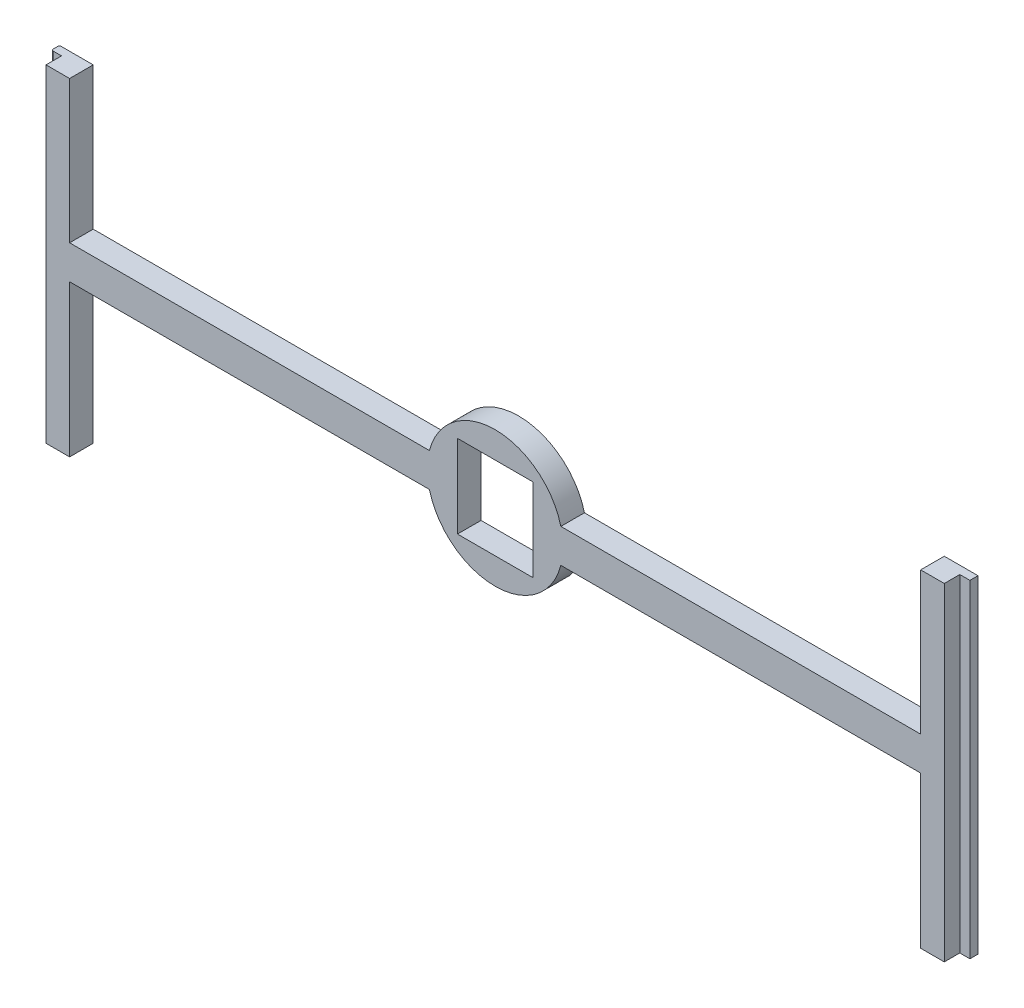
ISO-10303-21;
HEADER;
FILE_DESCRIPTION(('STEP AP214'),'2;1');
FILE_NAME('part.step','',(''),(''),'','','');
FILE_SCHEMA(('AUTOMOTIVE_DESIGN { 1 0 10303 214 1 1 1 1 }'));
ENDSEC;
DATA;
#1=APPLICATION_CONTEXT('core data for automotive mechanical design processes');
#2=APPLICATION_PROTOCOL_DEFINITION('international standard','automotive_design',2000,#1);
#3=PRODUCT_CONTEXT('',#1,'mechanical');
#4=PRODUCT('Part','Part','',(#3));
#5=PRODUCT_RELATED_PRODUCT_CATEGORY('part','',(#4));
#6=PRODUCT_DEFINITION_FORMATION('','',#4);
#7=PRODUCT_DEFINITION_CONTEXT('part definition',#1,'design');
#8=PRODUCT_DEFINITION('design','',#6,#7);
#9=PRODUCT_DEFINITION_SHAPE('','',#8);
#10=(LENGTH_UNIT() NAMED_UNIT(*) SI_UNIT(.MILLI.,.METRE.));
#11=(NAMED_UNIT(*) PLANE_ANGLE_UNIT() SI_UNIT($,.RADIAN.));
#12=(NAMED_UNIT(*) SI_UNIT($,.STERADIAN.) SOLID_ANGLE_UNIT());
#13=UNCERTAINTY_MEASURE_WITH_UNIT(LENGTH_MEASURE(1.E-05),#10,'distance_accuracy_value','');
#14=(GEOMETRIC_REPRESENTATION_CONTEXT(3) GLOBAL_UNCERTAINTY_ASSIGNED_CONTEXT((#13)) GLOBAL_UNIT_ASSIGNED_CONTEXT((#10,
#11,#12)) REPRESENTATION_CONTEXT('',''));
#15=CARTESIAN_POINT('',(0.,0.,0.));
#16=DIRECTION('',(0.,0.,1.));
#17=DIRECTION('',(1.,0.,0.));
#18=AXIS2_PLACEMENT_3D('',#15,#16,#17);
#19=CARTESIAN_POINT('',(0.,0.,3.5));
#20=DIRECTION('',(0.,0.,1.));
#21=DIRECTION('',(1.,0.,0.));
#22=AXIS2_PLACEMENT_3D('',#19,#20,#21);
#23=PLANE('',#22);
#24=DIRECTION('',(1.,0.,0.));
#25=VECTOR('',#24,1.);
#26=CARTESIAN_POINT('',(68.1,23.6,3.5));
#27=LINE('',#26,#25);
#28=CARTESIAN_POINT('',(-66.6,23.6,3.5));
#29=VERTEX_POINT('',#28);
#30=CARTESIAN_POINT('',(-63.1,23.6,3.5));
#31=VERTEX_POINT('',#30);
#32=EDGE_CURVE('E230',#29,#31,#27,.T.);
#33=ORIENTED_EDGE('',*,*,#32,.F.);
#34=DIRECTION('',(0.,-1.,0.));
#35=VECTOR('',#34,1.);
#36=CARTESIAN_POINT('',(-66.6,25.,3.49999999999998));
#37=LINE('',#36,#35);
#38=CARTESIAN_POINT('',(-66.6,-25.,3.49999999999998));
#39=VERTEX_POINT('',#38);
#40=EDGE_CURVE('E391',#29,#39,#37,.T.);
#41=ORIENTED_EDGE('',*,*,#40,.T.);
#42=DIRECTION('',(1.,0.,0.));
#43=VECTOR('',#42,1.);
#44=CARTESIAN_POINT('',(-63.1,-25.,3.5));
#45=LINE('',#44,#43);
#46=CARTESIAN_POINT('',(-63.1,-25.,3.5));
#47=VERTEX_POINT('',#46);
#48=EDGE_CURVE('E386',#39,#47,#45,.T.);
#49=ORIENTED_EDGE('',*,*,#48,.T.);
#50=DIRECTION('',(0.,1.,0.));
#51=VECTOR('',#50,1.);
#52=CARTESIAN_POINT('',(-63.1,-2.50000000000002,3.5));
#53=LINE('',#52,#51);
#54=CARTESIAN_POINT('',(-63.1,-2.50000000000002,3.5));
#55=VERTEX_POINT('',#54);
#56=EDGE_CURVE('E388',#47,#55,#53,.T.);
#57=ORIENTED_EDGE('',*,*,#56,.T.);
#58=DIRECTION('',(1.,0.,0.));
#59=VECTOR('',#58,1.);
#60=CARTESIAN_POINT('',(-63.1,-2.50000000000002,3.5));
#61=LINE('',#60,#59);
#62=CARTESIAN_POINT('',(-9.74276195747386,-2.50000000000002,3.5));
#63=VERTEX_POINT('',#62);
#64=EDGE_CURVE('E395',#55,#63,#61,.T.);
#65=ORIENTED_EDGE('',*,*,#64,.T.);
#66=CARTESIAN_POINT('',(0.,0.,3.5));
#67=DIRECTION('',(0.,0.,1.));
#68=DIRECTION('',(1.,0.,0.));
#69=AXIS2_PLACEMENT_3D('',#66,#67,#68);
#70=CIRCLE('',#69,10.0584);
#71=CARTESIAN_POINT('',(9.74276195747386,-2.50000000000002,3.5));
#72=VERTEX_POINT('',#71);
#73=EDGE_CURVE('E397',#63,#72,#70,.T.);
#74=ORIENTED_EDGE('',*,*,#73,.T.);
#75=DIRECTION('',(1.,0.,0.));
#76=VECTOR('',#75,1.);
#77=CARTESIAN_POINT('',(9.74276195747386,-2.50000000000002,3.5));
#78=LINE('',#77,#76);
#79=CARTESIAN_POINT('',(63.1,-2.5,3.5));
#80=VERTEX_POINT('',#79);
#81=EDGE_CURVE('E364',#72,#80,#78,.T.);
#82=ORIENTED_EDGE('',*,*,#81,.T.);
#83=DIRECTION('',(0.,-1.,0.));
#84=VECTOR('',#83,1.);
#85=CARTESIAN_POINT('',(63.1,-2.5,3.5));
#86=LINE('',#85,#84);
#87=CARTESIAN_POINT('',(63.1,-25.,3.5));
#88=VERTEX_POINT('',#87);
#89=EDGE_CURVE('E360',#80,#88,#86,.T.);
#90=ORIENTED_EDGE('',*,*,#89,.T.);
#91=DIRECTION('',(1.,0.,0.));
#92=VECTOR('',#91,1.);
#93=CARTESIAN_POINT('',(63.1,-25.,3.5));
#94=LINE('',#93,#92);
#95=CARTESIAN_POINT('',(66.6,-25.,3.5));
#96=VERTEX_POINT('',#95);
#97=EDGE_CURVE('E354',#88,#96,#94,.T.);
#98=ORIENTED_EDGE('',*,*,#97,.T.);
#99=DIRECTION('',(0.,-1.,0.));
#100=VECTOR('',#99,1.);
#101=CARTESIAN_POINT('',(66.6,25.,3.5));
#102=LINE('',#101,#100);
#103=CARTESIAN_POINT('',(66.6,23.6,3.5));
#104=VERTEX_POINT('',#103);
#105=EDGE_CURVE('E333',#104,#96,#102,.T.);
#106=ORIENTED_EDGE('',*,*,#105,.F.);
#107=CARTESIAN_POINT('',(63.1,23.6,3.5));
#108=VERTEX_POINT('',#107);
#109=EDGE_CURVE('E454',#108,#104,#27,.T.);
#110=ORIENTED_EDGE('',*,*,#109,.F.);
#111=DIRECTION('',(0.,-1.,0.));
#112=VECTOR('',#111,1.);
#113=CARTESIAN_POINT('',(63.1,25.,3.5));
#114=LINE('',#113,#112);
#115=CARTESIAN_POINT('',(63.1,2.5,3.5));
#116=VERTEX_POINT('',#115);
#117=EDGE_CURVE('E359',#108,#116,#114,.T.);
#118=ORIENTED_EDGE('',*,*,#117,.T.);
#119=DIRECTION('',(-1.,0.,0.));
#120=VECTOR('',#119,1.);
#121=CARTESIAN_POINT('',(9.74276195747386,2.50000000000002,3.5));
#122=LINE('',#121,#120);
#123=CARTESIAN_POINT('',(9.74276195747386,2.50000000000002,3.5));
#124=VERTEX_POINT('',#123);
#125=EDGE_CURVE('E362',#116,#124,#122,.T.);
#126=ORIENTED_EDGE('',*,*,#125,.T.);
#127=CARTESIAN_POINT('',(0.,0.,3.5));
#128=DIRECTION('',(0.,0.,1.));
#129=DIRECTION('',(1.,0.,0.));
#130=AXIS2_PLACEMENT_3D('',#127,#128,#129);
#131=CIRCLE('',#130,10.0584);
#132=CARTESIAN_POINT('',(-9.74276195747386,2.50000000000002,3.5));
#133=VERTEX_POINT('',#132);
#134=EDGE_CURVE('E369',#124,#133,#131,.T.);
#135=ORIENTED_EDGE('',*,*,#134,.T.);
#136=DIRECTION('',(-1.,0.,0.));
#137=VECTOR('',#136,1.);
#138=CARTESIAN_POINT('',(-63.1,2.50000000000002,3.5));
#139=LINE('',#138,#137);
#140=CARTESIAN_POINT('',(-63.1,2.50000000000002,3.5));
#141=VERTEX_POINT('',#140);
#142=EDGE_CURVE('E254',#133,#141,#139,.T.);
#143=ORIENTED_EDGE('',*,*,#142,.T.);
#144=DIRECTION('',(0.,1.,0.));
#145=VECTOR('',#144,1.);
#146=CARTESIAN_POINT('',(-63.1,25.,3.5));
#147=LINE('',#146,#145);
#148=EDGE_CURVE('E249',#141,#31,#147,.T.);
#149=ORIENTED_EDGE('',*,*,#148,.T.);
#150=EDGE_LOOP('',(#33,#41,#49,#57,#65,#74,#82,#90,#98,#106,#110,#118,#126,#135,#143,#149));
#151=FACE_BOUND('',#150,.T.);
#152=DIRECTION('',(0.,1.,0.));
#153=VECTOR('',#152,1.);
#154=CARTESIAN_POINT('',(5.588,-6.1468,3.5));
#155=LINE('',#154,#153);
#156=CARTESIAN_POINT('',(5.588,-6.1468,3.5));
#157=VERTEX_POINT('',#156);
#158=CARTESIAN_POINT('',(5.588,6.1468,3.5));
#159=VERTEX_POINT('',#158);
#160=EDGE_CURVE('E467',#157,#159,#155,.T.);
#161=ORIENTED_EDGE('',*,*,#160,.F.);
#162=DIRECTION('',(1.,0.,0.));
#163=VECTOR('',#162,1.);
#164=CARTESIAN_POINT('',(-5.588,-6.1468,3.5));
#165=LINE('',#164,#163);
#166=CARTESIAN_POINT('',(-5.588,-6.1468,3.5));
#167=VERTEX_POINT('',#166);
#168=EDGE_CURVE('E478',#167,#157,#165,.T.);
#169=ORIENTED_EDGE('',*,*,#168,.F.);
#170=DIRECTION('',(0.,-1.,0.));
#171=VECTOR('',#170,1.);
#172=CARTESIAN_POINT('',(-5.588,-6.1468,3.5));
#173=LINE('',#172,#171);
#174=CARTESIAN_POINT('',(-5.588,6.1468,3.5));
#175=VERTEX_POINT('',#174);
#176=EDGE_CURVE('E475',#175,#167,#173,.T.);
#177=ORIENTED_EDGE('',*,*,#176,.F.);
#178=DIRECTION('',(-1.,0.,0.));
#179=VECTOR('',#178,1.);
#180=CARTESIAN_POINT('',(-5.588,6.1468,3.5));
#181=LINE('',#180,#179);
#182=EDGE_CURVE('E469',#159,#175,#181,.T.);
#183=ORIENTED_EDGE('',*,*,#182,.F.);
#184=EDGE_LOOP('',(#161,#169,#177,#183));
#185=FACE_BOUND('',#184,.T.);
#186=ADVANCED_FACE('F35',(#151,#185),#23,.T.);
#187=CARTESIAN_POINT('',(0.,0.,0.));
#188=DIRECTION('',(0.,0.,1.));
#189=DIRECTION('',(1.,0.,0.));
#190=AXIS2_PLACEMENT_3D('',#187,#188,#189);
#191=PLANE('',#190);
#192=DIRECTION('',(1.,0.,0.));
#193=VECTOR('',#192,1.);
#194=CARTESIAN_POINT('',(0.,-6.1468,0.));
#195=LINE('',#194,#193);
#196=CARTESIAN_POINT('',(-5.588,-6.1468,0.));
#197=VERTEX_POINT('',#196);
#198=CARTESIAN_POINT('',(5.588,-6.1468,0.));
#199=VERTEX_POINT('',#198);
#200=EDGE_CURVE('E291',#197,#199,#195,.T.);
#201=ORIENTED_EDGE('',*,*,#200,.T.);
#202=DIRECTION('',(0.,1.,0.));
#203=VECTOR('',#202,1.);
#204=CARTESIAN_POINT('',(5.588,0.,0.));
#205=LINE('',#204,#203);
#206=CARTESIAN_POINT('',(5.588,6.1468,0.));
#207=VERTEX_POINT('',#206);
#208=EDGE_CURVE('E294',#199,#207,#205,.T.);
#209=ORIENTED_EDGE('',*,*,#208,.T.);
#210=DIRECTION('',(-1.,0.,0.));
#211=VECTOR('',#210,1.);
#212=CARTESIAN_POINT('',(0.,6.1468,0.));
#213=LINE('',#212,#211);
#214=CARTESIAN_POINT('',(-5.588,6.1468,0.));
#215=VERTEX_POINT('',#214);
#216=EDGE_CURVE('E285',#207,#215,#213,.T.);
#217=ORIENTED_EDGE('',*,*,#216,.T.);
#218=DIRECTION('',(0.,-1.,0.));
#219=VECTOR('',#218,1.);
#220=CARTESIAN_POINT('',(-5.588,0.,0.));
#221=LINE('',#220,#219);
#222=EDGE_CURVE('E288',#215,#197,#221,.T.);
#223=ORIENTED_EDGE('',*,*,#222,.T.);
#224=EDGE_LOOP('',(#201,#209,#217,#223));
#225=FACE_BOUND('',#224,.T.);
#226=DIRECTION('',(1.,0.,0.));
#227=VECTOR('',#226,1.);
#228=CARTESIAN_POINT('',(-63.1,-25.,0.));
#229=LINE('',#228,#227);
#230=CARTESIAN_POINT('',(-67.8,-25.,0.));
#231=VERTEX_POINT('',#230);
#232=CARTESIAN_POINT('',(-63.1,-25.,0.));
#233=VERTEX_POINT('',#232);
#234=EDGE_CURVE('E324',#231,#233,#229,.T.);
#235=ORIENTED_EDGE('',*,*,#234,.F.);
#236=DIRECTION('',(0.,-1.,0.));
#237=VECTOR('',#236,1.);
#238=CARTESIAN_POINT('',(-67.8,0.,0.));
#239=LINE('',#238,#237);
#240=CARTESIAN_POINT('',(-67.8,23.6,0.));
#241=VERTEX_POINT('',#240);
#242=EDGE_CURVE('E58',#231,#241,#239,.F.);
#243=ORIENTED_EDGE('',*,*,#242,.T.);
#244=DIRECTION('',(1.,0.,0.));
#245=VECTOR('',#244,1.);
#246=CARTESIAN_POINT('',(68.1,23.6,0.));
#247=LINE('',#246,#245);
#248=CARTESIAN_POINT('',(-63.1,23.6,0.));
#249=VERTEX_POINT('',#248);
#250=EDGE_CURVE('E229',#241,#249,#247,.T.);
#251=ORIENTED_EDGE('',*,*,#250,.T.);
#252=DIRECTION('',(0.,1.,0.));
#253=VECTOR('',#252,1.);
#254=CARTESIAN_POINT('',(-63.1,25.,0.));
#255=LINE('',#254,#253);
#256=CARTESIAN_POINT('',(-63.1,2.50000000000002,0.));
#257=VERTEX_POINT('',#256);
#258=EDGE_CURVE('E328',#257,#249,#255,.T.);
#259=ORIENTED_EDGE('',*,*,#258,.F.);
#260=DIRECTION('',(-1.,0.,0.));
#261=VECTOR('',#260,1.);
#262=CARTESIAN_POINT('',(-63.1,2.50000000000002,0.));
#263=LINE('',#262,#261);
#264=CARTESIAN_POINT('',(-9.74276195747386,2.50000000000002,0.));
#265=VERTEX_POINT('',#264);
#266=EDGE_CURVE('E247',#265,#257,#263,.T.);
#267=ORIENTED_EDGE('',*,*,#266,.F.);
#268=CARTESIAN_POINT('',(0.,0.,0.));
#269=DIRECTION('',(0.,0.,1.));
#270=DIRECTION('',(1.,0.,0.));
#271=AXIS2_PLACEMENT_3D('',#268,#269,#270);
#272=CIRCLE('',#271,10.0584);
#273=CARTESIAN_POINT('',(9.74276195747386,2.50000000000002,0.));
#274=VERTEX_POINT('',#273);
#275=EDGE_CURVE('E245',#274,#265,#272,.T.);
#276=ORIENTED_EDGE('',*,*,#275,.F.);
#277=DIRECTION('',(-1.,0.,0.));
#278=VECTOR('',#277,1.);
#279=CARTESIAN_POINT('',(9.74276195747386,2.50000000000002,0.));
#280=LINE('',#279,#278);
#281=CARTESIAN_POINT('',(63.1,2.5,0.));
#282=VERTEX_POINT('',#281);
#283=EDGE_CURVE('E238',#282,#274,#280,.T.);
#284=ORIENTED_EDGE('',*,*,#283,.F.);
#285=DIRECTION('',(0.,-1.,0.));
#286=VECTOR('',#285,1.);
#287=CARTESIAN_POINT('',(63.1,25.,0.));
#288=LINE('',#287,#286);
#289=CARTESIAN_POINT('',(63.1,23.6,0.));
#290=VERTEX_POINT('',#289);
#291=EDGE_CURVE('E228',#290,#282,#288,.T.);
#292=ORIENTED_EDGE('',*,*,#291,.F.);
#293=CARTESIAN_POINT('',(68.1,23.6,0.));
#294=VERTEX_POINT('',#293);
#295=EDGE_CURVE('E212',#290,#294,#247,.T.);
#296=ORIENTED_EDGE('',*,*,#295,.T.);
#297=DIRECTION('',(0.,1.,0.));
#298=VECTOR('',#297,1.);
#299=CARTESIAN_POINT('',(68.1,25.,0.));
#300=LINE('',#299,#298);
#301=CARTESIAN_POINT('',(68.1,-25.,0.));
#302=VERTEX_POINT('',#301);
#303=EDGE_CURVE('E226',#302,#294,#300,.T.);
#304=ORIENTED_EDGE('',*,*,#303,.F.);
#305=DIRECTION('',(1.,0.,0.));
#306=VECTOR('',#305,1.);
#307=CARTESIAN_POINT('',(63.1,-25.,0.));
#308=LINE('',#307,#306);
#309=CARTESIAN_POINT('',(63.1,-25.,0.));
#310=VERTEX_POINT('',#309);
#311=EDGE_CURVE('E236',#310,#302,#308,.T.);
#312=ORIENTED_EDGE('',*,*,#311,.F.);
#313=DIRECTION('',(0.,-1.,0.));
#314=VECTOR('',#313,1.);
#315=CARTESIAN_POINT('',(63.1,-2.5,0.));
#316=LINE('',#315,#314);
#317=CARTESIAN_POINT('',(63.1,-2.5,0.));
#318=VERTEX_POINT('',#317);
#319=EDGE_CURVE('E240',#318,#310,#316,.T.);
#320=ORIENTED_EDGE('',*,*,#319,.F.);
#321=DIRECTION('',(1.,0.,0.));
#322=VECTOR('',#321,1.);
#323=CARTESIAN_POINT('',(9.74276195747386,-2.50000000000002,0.));
#324=LINE('',#323,#322);
#325=CARTESIAN_POINT('',(9.74276195747386,-2.50000000000002,0.));
#326=VERTEX_POINT('',#325);
#327=EDGE_CURVE('E340',#326,#318,#324,.T.);
#328=ORIENTED_EDGE('',*,*,#327,.F.);
#329=CARTESIAN_POINT('',(0.,0.,0.));
#330=DIRECTION('',(0.,0.,1.));
#331=DIRECTION('',(1.,0.,0.));
#332=AXIS2_PLACEMENT_3D('',#329,#330,#331);
#333=CIRCLE('',#332,10.0584);
#334=CARTESIAN_POINT('',(-9.74276195747386,-2.50000000000002,0.));
#335=VERTEX_POINT('',#334);
#336=EDGE_CURVE('E338',#335,#326,#333,.T.);
#337=ORIENTED_EDGE('',*,*,#336,.F.);
#338=DIRECTION('',(1.,0.,0.));
#339=VECTOR('',#338,1.);
#340=CARTESIAN_POINT('',(-63.1,-2.50000000000002,0.));
#341=LINE('',#340,#339);
#342=CARTESIAN_POINT('',(-63.1,-2.50000000000002,0.));
#343=VERTEX_POINT('',#342);
#344=EDGE_CURVE('E330',#343,#335,#341,.T.);
#345=ORIENTED_EDGE('',*,*,#344,.F.);
#346=DIRECTION('',(0.,1.,0.));
#347=VECTOR('',#346,1.);
#348=CARTESIAN_POINT('',(-63.1,-2.50000000000002,0.));
#349=LINE('',#348,#347);
#350=EDGE_CURVE('E327',#233,#343,#349,.T.);
#351=ORIENTED_EDGE('',*,*,#350,.F.);
#352=EDGE_LOOP('',(#235,#243,#251,#259,#267,#276,#284,#292,#296,#304,#312,#320,#328,#337,#345,#351));
#353=FACE_BOUND('',#352,.T.);
#354=ADVANCED_FACE('F224',(#225,#353),#191,.F.);
#355=CARTESIAN_POINT('',(-63.1,25.,3.5));
#356=DIRECTION('',(-1.,0.,0.));
#357=DIRECTION('',(0.,-1.,0.));
#358=AXIS2_PLACEMENT_3D('',#355,#356,#357);
#359=PLANE('',#358);
#360=ORIENTED_EDGE('',*,*,#258,.T.);
#361=DIRECTION('',(0.,0.,1.));
#362=VECTOR('',#361,1.);
#363=CARTESIAN_POINT('',(-63.1,23.6,3.5));
#364=LINE('',#363,#362);
#365=EDGE_CURVE('E385',#249,#31,#364,.T.);
#366=ORIENTED_EDGE('',*,*,#365,.T.);
#367=ORIENTED_EDGE('',*,*,#148,.F.);
#368=DIRECTION('',(0.,0.,-1.));
#369=VECTOR('',#368,1.);
#370=CARTESIAN_POINT('',(-63.1,2.50000000000002,3.5));
#371=LINE('',#370,#369);
#372=EDGE_CURVE('E250',#141,#257,#371,.T.);
#373=ORIENTED_EDGE('',*,*,#372,.T.);
#374=EDGE_LOOP('',(#360,#366,#367,#373));
#375=FACE_BOUND('',#374,.T.);
#376=ADVANCED_FACE('F384',(#375),#359,.F.);
#377=CARTESIAN_POINT('',(-68.1,25.,3.5));
#378=DIRECTION('',(1.,0.,0.));
#379=DIRECTION('',(0.,0.,-1.));
#380=AXIS2_PLACEMENT_3D('',#377,#378,#379);
#381=PLANE('',#380);
#382=DIRECTION('',(0.,0.,1.));
#383=VECTOR('',#382,1.);
#384=CARTESIAN_POINT('',(-68.1,23.6,0.));
#385=LINE('',#384,#383);
#386=CARTESIAN_POINT('',(-68.1,23.6,0.3));
#387=VERTEX_POINT('',#386);
#388=CARTESIAN_POINT('',(-68.1,23.6,0.899999999999984));
#389=VERTEX_POINT('',#388);
#390=EDGE_CURVE('E220',#387,#389,#385,.T.);
#391=ORIENTED_EDGE('',*,*,#390,.F.);
#392=DIRECTION('',(0.,-1.,0.));
#393=VECTOR('',#392,1.);
#394=CARTESIAN_POINT('',(-68.1,25.,0.3));
#395=LINE('',#394,#393);
#396=CARTESIAN_POINT('',(-68.1,-25.,0.3));
#397=VERTEX_POINT('',#396);
#398=EDGE_CURVE('E301',#387,#397,#395,.T.);
#399=ORIENTED_EDGE('',*,*,#398,.T.);
#400=DIRECTION('',(0.,0.,-1.));
#401=VECTOR('',#400,1.);
#402=CARTESIAN_POINT('',(-68.1,-25.,3.5));
#403=LINE('',#402,#401);
#404=CARTESIAN_POINT('',(-68.1,-25.,0.899999999999984));
#405=VERTEX_POINT('',#404);
#406=EDGE_CURVE('E282',#405,#397,#403,.T.);
#407=ORIENTED_EDGE('',*,*,#406,.F.);
#408=DIRECTION('',(0.,-1.,0.));
#409=VECTOR('',#408,1.);
#410=CARTESIAN_POINT('',(-68.1,25.,0.899999999999984));
#411=LINE('',#410,#409);
#412=EDGE_CURVE('E299',#405,#389,#411,.F.);
#413=ORIENTED_EDGE('',*,*,#412,.T.);
#414=EDGE_LOOP('',(#391,#399,#407,#413));
#415=FACE_BOUND('',#414,.T.);
#416=ADVANCED_FACE('F316',(#415),#381,.F.);
#417=CARTESIAN_POINT('',(-63.1,-25.,3.5));
#418=DIRECTION('',(0.,1.,0.));
#419=DIRECTION('',(-1.,0.,0.));
#420=AXIS2_PLACEMENT_3D('',#417,#418,#419);
#421=PLANE('',#420);
#422=ORIENTED_EDGE('',*,*,#406,.T.);
#423=CARTESIAN_POINT('',(-67.8,-25.,0.3));
#424=DIRECTION('',(0.,1.,0.));
#425=DIRECTION('',(-1.,0.,0.));
#426=AXIS2_PLACEMENT_3D('',#423,#424,#425);
#427=CIRCLE('',#426,0.3);
#428=EDGE_CURVE('E306',#397,#231,#427,.F.);
#429=ORIENTED_EDGE('',*,*,#428,.T.);
#430=ORIENTED_EDGE('',*,*,#234,.T.);
#431=DIRECTION('',(0.,0.,-1.));
#432=VECTOR('',#431,1.);
#433=CARTESIAN_POINT('',(-63.1,-25.,3.5));
#434=LINE('',#433,#432);
#435=EDGE_CURVE('E279',#47,#233,#434,.T.);
#436=ORIENTED_EDGE('',*,*,#435,.F.);
#437=ORIENTED_EDGE('',*,*,#48,.F.);
#438=DIRECTION('',(0.,0.,1.));
#439=VECTOR('',#438,1.);
#440=CARTESIAN_POINT('',(-66.6,-25.,3.49999999999998));
#441=LINE('',#440,#439);
#442=CARTESIAN_POINT('',(-66.6,-25.,1.19999999999998));
#443=VERTEX_POINT('',#442);
#444=EDGE_CURVE('E418',#443,#39,#441,.T.);
#445=ORIENTED_EDGE('',*,*,#444,.F.);
#446=DIRECTION('',(1.,0.,0.));
#447=VECTOR('',#446,1.);
#448=CARTESIAN_POINT('',(-66.6,-25.,1.19999999999998));
#449=LINE('',#448,#447);
#450=CARTESIAN_POINT('',(-67.8,-25.,1.19999999999998));
#451=VERTEX_POINT('',#450);
#452=EDGE_CURVE('E423',#451,#443,#449,.T.);
#453=ORIENTED_EDGE('',*,*,#452,.F.);
#454=CARTESIAN_POINT('',(-67.8,-25.,0.899999999999984));
#455=DIRECTION('',(0.,1.,0.));
#456=DIRECTION('',(-1.,0.,0.));
#457=AXIS2_PLACEMENT_3D('',#454,#455,#456);
#458=CIRCLE('',#457,0.3);
#459=EDGE_CURVE('E304',#451,#405,#458,.F.);
#460=ORIENTED_EDGE('',*,*,#459,.T.);
#461=EDGE_LOOP('',(#422,#429,#430,#436,#437,#445,#453,#460));
#462=FACE_BOUND('',#461,.T.);
#463=ADVANCED_FACE('F322',(#462),#421,.F.);
#464=CARTESIAN_POINT('',(-63.1,-2.50000000000002,3.5));
#465=DIRECTION('',(-1.,0.,0.));
#466=DIRECTION('',(0.,-1.,0.));
#467=AXIS2_PLACEMENT_3D('',#464,#465,#466);
#468=PLANE('',#467);
#469=ORIENTED_EDGE('',*,*,#350,.T.);
#470=DIRECTION('',(0.,0.,-1.));
#471=VECTOR('',#470,1.);
#472=CARTESIAN_POINT('',(-63.1,-2.50000000000002,3.5));
#473=LINE('',#472,#471);
#474=EDGE_CURVE('E276',#55,#343,#473,.T.);
#475=ORIENTED_EDGE('',*,*,#474,.F.);
#476=ORIENTED_EDGE('',*,*,#56,.F.);
#477=ORIENTED_EDGE('',*,*,#435,.T.);
#478=EDGE_LOOP('',(#469,#475,#476,#477));
#479=FACE_BOUND('',#478,.T.);
#480=ADVANCED_FACE('F413',(#479),#468,.F.);
#481=CARTESIAN_POINT('',(-63.1,-2.50000000000002,3.5));
#482=DIRECTION('',(0.,1.,0.));
#483=DIRECTION('',(-1.,0.,0.));
#484=AXIS2_PLACEMENT_3D('',#481,#482,#483);
#485=PLANE('',#484);
#486=ORIENTED_EDGE('',*,*,#344,.T.);
#487=DIRECTION('',(0.,0.,-1.));
#488=VECTOR('',#487,1.);
#489=CARTESIAN_POINT('',(-9.74276195747386,-2.50000000000002,3.5));
#490=LINE('',#489,#488);
#491=EDGE_CURVE('E273',#63,#335,#490,.T.);
#492=ORIENTED_EDGE('',*,*,#491,.F.);
#493=ORIENTED_EDGE('',*,*,#64,.F.);
#494=ORIENTED_EDGE('',*,*,#474,.T.);
#495=EDGE_LOOP('',(#486,#492,#493,#494));
#496=FACE_BOUND('',#495,.T.);
#497=ADVANCED_FACE('F409',(#496),#485,.F.);
#498=CARTESIAN_POINT('',(0.,0.,3.5));
#499=DIRECTION('',(0.,0.,-1.));
#500=DIRECTION('',(-1.,0.,0.));
#501=AXIS2_PLACEMENT_3D('',#498,#499,#500);
#502=CYLINDRICAL_SURFACE('',#501,10.0584);
#503=ORIENTED_EDGE('',*,*,#336,.T.);
#504=DIRECTION('',(0.,0.,-1.));
#505=VECTOR('',#504,1.);
#506=CARTESIAN_POINT('',(9.74276195747386,-2.50000000000002,3.5));
#507=LINE('',#506,#505);
#508=EDGE_CURVE('E270',#72,#326,#507,.T.);
#509=ORIENTED_EDGE('',*,*,#508,.F.);
#510=ORIENTED_EDGE('',*,*,#73,.F.);
#511=ORIENTED_EDGE('',*,*,#491,.T.);
#512=EDGE_LOOP('',(#503,#509,#510,#511));
#513=FACE_BOUND('',#512,.T.);
#514=ADVANCED_FACE('F405',(#513),#502,.T.);
#515=CARTESIAN_POINT('',(9.74276195747386,-2.50000000000002,3.5));
#516=DIRECTION('',(0.,1.,0.));
#517=DIRECTION('',(-1.,0.,0.));
#518=AXIS2_PLACEMENT_3D('',#515,#516,#517);
#519=PLANE('',#518);
#520=ORIENTED_EDGE('',*,*,#327,.T.);
#521=DIRECTION('',(0.,0.,-1.));
#522=VECTOR('',#521,1.);
#523=CARTESIAN_POINT('',(63.1,-2.5,3.5));
#524=LINE('',#523,#522);
#525=EDGE_CURVE('E267',#80,#318,#524,.T.);
#526=ORIENTED_EDGE('',*,*,#525,.F.);
#527=ORIENTED_EDGE('',*,*,#81,.F.);
#528=ORIENTED_EDGE('',*,*,#508,.T.);
#529=EDGE_LOOP('',(#520,#526,#527,#528));
#530=FACE_BOUND('',#529,.T.);
#531=ADVANCED_FACE('F402',(#530),#519,.F.);
#532=CARTESIAN_POINT('',(63.1,-2.5,3.5));
#533=DIRECTION('',(1.,0.,0.));
#534=DIRECTION('',(0.,1.,0.));
#535=AXIS2_PLACEMENT_3D('',#532,#533,#534);
#536=PLANE('',#535);
#537=ORIENTED_EDGE('',*,*,#319,.T.);
#538=DIRECTION('',(0.,0.,-1.));
#539=VECTOR('',#538,1.);
#540=CARTESIAN_POINT('',(63.1,-25.,3.5));
#541=LINE('',#540,#539);
#542=EDGE_CURVE('E264',#88,#310,#541,.T.);
#543=ORIENTED_EDGE('',*,*,#542,.F.);
#544=ORIENTED_EDGE('',*,*,#89,.F.);
#545=ORIENTED_EDGE('',*,*,#525,.T.);
#546=EDGE_LOOP('',(#537,#543,#544,#545));
#547=FACE_BOUND('',#546,.T.);
#548=ADVANCED_FACE('F344',(#547),#536,.F.);
#549=CARTESIAN_POINT('',(63.1,-25.,3.5));
#550=DIRECTION('',(0.,1.,0.));
#551=DIRECTION('',(0.,0.,1.));
#552=AXIS2_PLACEMENT_3D('',#549,#550,#551);
#553=PLANE('',#552);
#554=DIRECTION('',(1.,0.,0.));
#555=VECTOR('',#554,1.);
#556=CARTESIAN_POINT('',(66.6,-25.,1.2));
#557=LINE('',#556,#555);
#558=CARTESIAN_POINT('',(66.6,-25.,1.2));
#559=VERTEX_POINT('',#558);
#560=CARTESIAN_POINT('',(68.1,-25.,1.2));
#561=VERTEX_POINT('',#560);
#562=EDGE_CURVE('E435',#559,#561,#557,.T.);
#563=ORIENTED_EDGE('',*,*,#562,.F.);
#564=DIRECTION('',(0.,0.,-1.));
#565=VECTOR('',#564,1.);
#566=CARTESIAN_POINT('',(66.6,-25.,3.5));
#567=LINE('',#566,#565);
#568=EDGE_CURVE('E356',#96,#559,#567,.T.);
#569=ORIENTED_EDGE('',*,*,#568,.F.);
#570=ORIENTED_EDGE('',*,*,#97,.F.);
#571=ORIENTED_EDGE('',*,*,#542,.T.);
#572=ORIENTED_EDGE('',*,*,#311,.T.);
#573=DIRECTION('',(0.,0.,-1.));
#574=VECTOR('',#573,1.);
#575=CARTESIAN_POINT('',(68.1,-25.,3.5));
#576=LINE('',#575,#574);
#577=EDGE_CURVE('E234',#561,#302,#576,.T.);
#578=ORIENTED_EDGE('',*,*,#577,.F.);
#579=EDGE_LOOP('',(#563,#569,#570,#571,#572,#578));
#580=FACE_BOUND('',#579,.T.);
#581=ADVANCED_FACE('F351',(#580),#553,.F.);
#582=CARTESIAN_POINT('',(68.1,25.,3.5));
#583=DIRECTION('',(-1.,0.,0.));
#584=DIRECTION('',(0.,0.,1.));
#585=AXIS2_PLACEMENT_3D('',#582,#583,#584);
#586=PLANE('',#585);
#587=ORIENTED_EDGE('',*,*,#303,.T.);
#588=DIRECTION('',(0.,0.,1.));
#589=VECTOR('',#588,1.);
#590=CARTESIAN_POINT('',(68.1,23.6,0.));
#591=LINE('',#590,#589);
#592=CARTESIAN_POINT('',(68.1,23.6,1.2));
#593=VERTEX_POINT('',#592);
#594=EDGE_CURVE('E209',#294,#593,#591,.T.);
#595=ORIENTED_EDGE('',*,*,#594,.T.);
#596=DIRECTION('',(0.,-1.,0.));
#597=VECTOR('',#596,1.);
#598=CARTESIAN_POINT('',(68.1,25.,1.2));
#599=LINE('',#598,#597);
#600=EDGE_CURVE('E445',#593,#561,#599,.T.);
#601=ORIENTED_EDGE('',*,*,#600,.T.);
#602=ORIENTED_EDGE('',*,*,#577,.T.);
#603=EDGE_LOOP('',(#587,#595,#601,#602));
#604=FACE_BOUND('',#603,.T.);
#605=ADVANCED_FACE('F232',(#604),#586,.F.);
#606=CARTESIAN_POINT('',(63.1,25.,3.5));
#607=DIRECTION('',(1.,0.,0.));
#608=DIRECTION('',(0.,1.,0.));
#609=AXIS2_PLACEMENT_3D('',#606,#607,#608);
#610=PLANE('',#609);
#611=ORIENTED_EDGE('',*,*,#117,.F.);
#612=DIRECTION('',(0.,0.,-1.));
#613=VECTOR('',#612,1.);
#614=CARTESIAN_POINT('',(63.1,23.6,3.5));
#615=LINE('',#614,#613);
#616=EDGE_CURVE('E451',#108,#290,#615,.T.);
#617=ORIENTED_EDGE('',*,*,#616,.T.);
#618=ORIENTED_EDGE('',*,*,#291,.T.);
#619=DIRECTION('',(0.,0.,-1.));
#620=VECTOR('',#619,1.);
#621=CARTESIAN_POINT('',(63.1,2.5,3.5));
#622=LINE('',#621,#620);
#623=EDGE_CURVE('E260',#116,#282,#622,.T.);
#624=ORIENTED_EDGE('',*,*,#623,.F.);
#625=EDGE_LOOP('',(#611,#617,#618,#624));
#626=FACE_BOUND('',#625,.T.);
#627=ADVANCED_FACE('F459',(#626),#610,.F.);
#628=CARTESIAN_POINT('',(9.74276195747386,2.50000000000002,3.5));
#629=DIRECTION('',(0.,-1.,0.));
#630=DIRECTION('',(1.,0.,0.));
#631=AXIS2_PLACEMENT_3D('',#628,#629,#630);
#632=PLANE('',#631);
#633=ORIENTED_EDGE('',*,*,#283,.T.);
#634=DIRECTION('',(0.,0.,-1.));
#635=VECTOR('',#634,1.);
#636=CARTESIAN_POINT('',(9.74276195747386,2.50000000000002,3.5));
#637=LINE('',#636,#635);
#638=EDGE_CURVE('E257',#124,#274,#637,.T.);
#639=ORIENTED_EDGE('',*,*,#638,.F.);
#640=ORIENTED_EDGE('',*,*,#125,.F.);
#641=ORIENTED_EDGE('',*,*,#623,.T.);
#642=EDGE_LOOP('',(#633,#639,#640,#641));
#643=FACE_BOUND('',#642,.T.);
#644=ADVANCED_FACE('F463',(#643),#632,.F.);
#645=CARTESIAN_POINT('',(0.,0.,3.5));
#646=DIRECTION('',(0.,0.,-1.));
#647=DIRECTION('',(-1.,0.,0.));
#648=AXIS2_PLACEMENT_3D('',#645,#646,#647);
#649=CYLINDRICAL_SURFACE('',#648,10.0584);
#650=ORIENTED_EDGE('',*,*,#275,.T.);
#651=DIRECTION('',(0.,0.,-1.));
#652=VECTOR('',#651,1.);
#653=CARTESIAN_POINT('',(-9.74276195747386,2.50000000000002,3.5));
#654=LINE('',#653,#652);
#655=EDGE_CURVE('E253',#133,#265,#654,.T.);
#656=ORIENTED_EDGE('',*,*,#655,.F.);
#657=ORIENTED_EDGE('',*,*,#134,.F.);
#658=ORIENTED_EDGE('',*,*,#638,.T.);
#659=EDGE_LOOP('',(#650,#656,#657,#658));
#660=FACE_BOUND('',#659,.T.);
#661=ADVANCED_FACE('F466',(#660),#649,.T.);
#662=CARTESIAN_POINT('',(-63.1,2.50000000000002,3.5));
#663=DIRECTION('',(0.,-1.,0.));
#664=DIRECTION('',(1.,0.,0.));
#665=AXIS2_PLACEMENT_3D('',#662,#663,#664);
#666=PLANE('',#665);
#667=ORIENTED_EDGE('',*,*,#266,.T.);
#668=ORIENTED_EDGE('',*,*,#372,.F.);
#669=ORIENTED_EDGE('',*,*,#142,.F.);
#670=ORIENTED_EDGE('',*,*,#655,.T.);
#671=EDGE_LOOP('',(#667,#668,#669,#670));
#672=FACE_BOUND('',#671,.T.);
#673=ADVANCED_FACE('F379',(#672),#666,.F.);
#674=CARTESIAN_POINT('',(66.6,25.,3.5));
#675=DIRECTION('',(-1.,0.,0.));
#676=DIRECTION('',(0.,0.,1.));
#677=AXIS2_PLACEMENT_3D('',#674,#675,#676);
#678=PLANE('',#677);
#679=DIRECTION('',(0.,-1.,0.));
#680=VECTOR('',#679,1.);
#681=CARTESIAN_POINT('',(66.6,25.,1.2));
#682=LINE('',#681,#680);
#683=CARTESIAN_POINT('',(66.6,23.6,1.2));
#684=VERTEX_POINT('',#683);
#685=EDGE_CURVE('E433',#684,#559,#682,.T.);
#686=ORIENTED_EDGE('',*,*,#685,.F.);
#687=DIRECTION('',(0.,0.,1.));
#688=VECTOR('',#687,1.);
#689=CARTESIAN_POINT('',(66.6,23.6,3.5));
#690=LINE('',#689,#688);
#691=EDGE_CURVE('E450',#684,#104,#690,.T.);
#692=ORIENTED_EDGE('',*,*,#691,.T.);
#693=ORIENTED_EDGE('',*,*,#105,.T.);
#694=ORIENTED_EDGE('',*,*,#568,.T.);
#695=EDGE_LOOP('',(#686,#692,#693,#694));
#696=FACE_BOUND('',#695,.T.);
#697=ADVANCED_FACE('F449',(#696),#678,.F.);
#698=CARTESIAN_POINT('',(66.6,25.,1.2));
#699=DIRECTION('',(0.,0.,-1.));
#700=DIRECTION('',(-1.,0.,0.));
#701=AXIS2_PLACEMENT_3D('',#698,#699,#700);
#702=PLANE('',#701);
#703=ORIENTED_EDGE('',*,*,#600,.F.);
#704=DIRECTION('',(-1.,0.,0.));
#705=VECTOR('',#704,1.);
#706=CARTESIAN_POINT('',(66.6,23.6,1.2));
#707=LINE('',#706,#705);
#708=EDGE_CURVE('E215',#593,#684,#707,.T.);
#709=ORIENTED_EDGE('',*,*,#708,.T.);
#710=ORIENTED_EDGE('',*,*,#685,.T.);
#711=ORIENTED_EDGE('',*,*,#562,.T.);
#712=EDGE_LOOP('',(#703,#709,#710,#711));
#713=FACE_BOUND('',#712,.T.);
#714=ADVANCED_FACE('F447',(#713),#702,.F.);
#715=CARTESIAN_POINT('',(-66.6,25.,3.49999999999998));
#716=DIRECTION('',(1.,0.,0.));
#717=DIRECTION('',(0.,0.,-1.));
#718=AXIS2_PLACEMENT_3D('',#715,#716,#717);
#719=PLANE('',#718);
#720=ORIENTED_EDGE('',*,*,#40,.F.);
#721=DIRECTION('',(0.,0.,-1.));
#722=VECTOR('',#721,1.);
#723=CARTESIAN_POINT('',(-66.6,23.6,3.49999999999998));
#724=LINE('',#723,#722);
#725=CARTESIAN_POINT('',(-66.6,23.6,1.19999999999998));
#726=VERTEX_POINT('',#725);
#727=EDGE_CURVE('E219',#29,#726,#724,.T.);
#728=ORIENTED_EDGE('',*,*,#727,.T.);
#729=DIRECTION('',(0.,-1.,0.));
#730=VECTOR('',#729,1.);
#731=CARTESIAN_POINT('',(-66.6,25.,1.19999999999998));
#732=LINE('',#731,#730);
#733=EDGE_CURVE('E422',#726,#443,#732,.T.);
#734=ORIENTED_EDGE('',*,*,#733,.T.);
#735=ORIENTED_EDGE('',*,*,#444,.T.);
#736=EDGE_LOOP('',(#720,#728,#734,#735));
#737=FACE_BOUND('',#736,.T.);
#738=ADVANCED_FACE('F425',(#737),#719,.F.);
#739=CARTESIAN_POINT('',(-66.6,25.,1.19999999999998));
#740=DIRECTION('',(0.,0.,-1.));
#741=DIRECTION('',(-1.,0.,0.));
#742=AXIS2_PLACEMENT_3D('',#739,#740,#741);
#743=PLANE('',#742);
#744=DIRECTION('',(-1.,0.,0.));
#745=VECTOR('',#744,1.);
#746=CARTESIAN_POINT('',(-66.6,23.6,1.19999999999998));
#747=LINE('',#746,#745);
#748=CARTESIAN_POINT('',(-67.8,23.6,1.19999999999998));
#749=VERTEX_POINT('',#748);
#750=EDGE_CURVE('E297',#726,#749,#747,.T.);
#751=ORIENTED_EDGE('',*,*,#750,.T.);
#752=DIRECTION('',(0.,-1.,0.));
#753=VECTOR('',#752,1.);
#754=CARTESIAN_POINT('',(-67.8,25.,1.19999999999998));
#755=LINE('',#754,#753);
#756=EDGE_CURVE('E11',#749,#451,#755,.T.);
#757=ORIENTED_EDGE('',*,*,#756,.T.);
#758=ORIENTED_EDGE('',*,*,#452,.T.);
#759=ORIENTED_EDGE('',*,*,#733,.F.);
#760=EDGE_LOOP('',(#751,#757,#758,#759));
#761=FACE_BOUND('',#760,.T.);
#762=ADVANCED_FACE('F507',(#761),#743,.F.);
#763=CARTESIAN_POINT('',(5.588,-6.1468,-0.309999999999999));
#764=DIRECTION('',(1.,0.,0.));
#765=DIRECTION('',(0.,0.,-1.));
#766=AXIS2_PLACEMENT_3D('',#763,#764,#765);
#767=PLANE('',#766);
#768=DIRECTION('',(0.,0.,1.));
#769=VECTOR('',#768,1.);
#770=CARTESIAN_POINT('',(5.588,-6.1468,-0.309999999999999));
#771=LINE('',#770,#769);
#772=EDGE_CURVE('E427',#199,#157,#771,.T.);
#773=ORIENTED_EDGE('',*,*,#772,.T.);
#774=ORIENTED_EDGE('',*,*,#160,.T.);
#775=DIRECTION('',(0.,0.,1.));
#776=VECTOR('',#775,1.);
#777=CARTESIAN_POINT('',(5.588,6.1468,-0.309999999999999));
#778=LINE('',#777,#776);
#779=EDGE_CURVE('E442',#207,#159,#778,.T.);
#780=ORIENTED_EDGE('',*,*,#779,.F.);
#781=ORIENTED_EDGE('',*,*,#208,.F.);
#782=EDGE_LOOP('',(#773,#774,#780,#781));
#783=FACE_BOUND('',#782,.T.);
#784=ADVANCED_FACE('F498',(#783),#767,.F.);
#785=CARTESIAN_POINT('',(-5.588,-6.1468,-0.309999999999999));
#786=DIRECTION('',(0.,-1.,0.));
#787=DIRECTION('',(0.,0.,-1.));
#788=AXIS2_PLACEMENT_3D('',#785,#786,#787);
#789=PLANE('',#788);
#790=DIRECTION('',(0.,0.,1.));
#791=VECTOR('',#790,1.);
#792=CARTESIAN_POINT('',(-5.588,-6.1468,-0.309999999999999));
#793=LINE('',#792,#791);
#794=EDGE_CURVE('E430',#197,#167,#793,.T.);
#795=ORIENTED_EDGE('',*,*,#794,.T.);
#796=ORIENTED_EDGE('',*,*,#168,.T.);
#797=ORIENTED_EDGE('',*,*,#772,.F.);
#798=ORIENTED_EDGE('',*,*,#200,.F.);
#799=EDGE_LOOP('',(#795,#796,#797,#798));
#800=FACE_BOUND('',#799,.T.);
#801=ADVANCED_FACE('F499',(#800),#789,.F.);
#802=CARTESIAN_POINT('',(-5.588,-6.1468,-0.309999999999999));
#803=DIRECTION('',(-1.,0.,0.));
#804=DIRECTION('',(0.,0.,1.));
#805=AXIS2_PLACEMENT_3D('',#802,#803,#804);
#806=PLANE('',#805);
#807=DIRECTION('',(0.,0.,1.));
#808=VECTOR('',#807,1.);
#809=CARTESIAN_POINT('',(-5.588,6.1468,-0.309999999999999));
#810=LINE('',#809,#808);
#811=EDGE_CURVE('E481',#215,#175,#810,.T.);
#812=ORIENTED_EDGE('',*,*,#811,.T.);
#813=ORIENTED_EDGE('',*,*,#176,.T.);
#814=ORIENTED_EDGE('',*,*,#794,.F.);
#815=ORIENTED_EDGE('',*,*,#222,.F.);
#816=EDGE_LOOP('',(#812,#813,#814,#815));
#817=FACE_BOUND('',#816,.T.);
#818=ADVANCED_FACE('F494',(#817),#806,.F.);
#819=CARTESIAN_POINT('',(-5.588,6.1468,-0.309999999999999));
#820=DIRECTION('',(0.,1.,0.));
#821=DIRECTION('',(0.,0.,1.));
#822=AXIS2_PLACEMENT_3D('',#819,#820,#821);
#823=PLANE('',#822);
#824=ORIENTED_EDGE('',*,*,#779,.T.);
#825=ORIENTED_EDGE('',*,*,#182,.T.);
#826=ORIENTED_EDGE('',*,*,#811,.F.);
#827=ORIENTED_EDGE('',*,*,#216,.F.);
#828=EDGE_LOOP('',(#824,#825,#826,#827));
#829=FACE_BOUND('',#828,.T.);
#830=ADVANCED_FACE('F488',(#829),#823,.F.);
#831=CARTESIAN_POINT('',(68.1,23.6,0.));
#832=DIRECTION('',(0.,-1.,0.));
#833=DIRECTION('',(1.,0.,0.));
#834=AXIS2_PLACEMENT_3D('',#831,#832,#833);
#835=PLANE('',#834);
#836=ORIENTED_EDGE('',*,*,#250,.F.);
#837=CARTESIAN_POINT('',(-67.8,23.6,0.3));
#838=DIRECTION('',(0.,-1.,0.));
#839=DIRECTION('',(1.,0.,0.));
#840=AXIS2_PLACEMENT_3D('',#837,#838,#839);
#841=CIRCLE('',#840,0.3);
#842=EDGE_CURVE('E43',#241,#387,#841,.F.);
#843=ORIENTED_EDGE('',*,*,#842,.T.);
#844=ORIENTED_EDGE('',*,*,#390,.T.);
#845=CARTESIAN_POINT('',(-67.8,23.6,0.899999999999984));
#846=DIRECTION('',(0.,-1.,0.));
#847=DIRECTION('',(1.,0.,0.));
#848=AXIS2_PLACEMENT_3D('',#845,#846,#847);
#849=CIRCLE('',#848,0.3);
#850=EDGE_CURVE('E50',#389,#749,#849,.F.);
#851=ORIENTED_EDGE('',*,*,#850,.T.);
#852=ORIENTED_EDGE('',*,*,#750,.F.);
#853=ORIENTED_EDGE('',*,*,#727,.F.);
#854=ORIENTED_EDGE('',*,*,#32,.T.);
#855=ORIENTED_EDGE('',*,*,#365,.F.);
#856=EDGE_LOOP('',(#836,#843,#844,#851,#852,#853,#854,#855));
#857=FACE_BOUND('',#856,.T.);
#858=ADVANCED_FACE('F311',(#857),#835,.F.);
#859=ORIENTED_EDGE('',*,*,#109,.T.);
#860=ORIENTED_EDGE('',*,*,#691,.F.);
#861=ORIENTED_EDGE('',*,*,#708,.F.);
#862=ORIENTED_EDGE('',*,*,#594,.F.);
#863=ORIENTED_EDGE('',*,*,#295,.F.);
#864=ORIENTED_EDGE('',*,*,#616,.F.);
#865=EDGE_LOOP('',(#859,#860,#861,#862,#863,#864));
#866=FACE_BOUND('',#865,.T.);
#867=ADVANCED_FACE('F211',(#866),#835,.F.);
#868=CARTESIAN_POINT('',(-67.8,25.,0.3));
#869=DIRECTION('',(0.,-1.,0.));
#870=DIRECTION('',(0.,0.,-1.));
#871=AXIS2_PLACEMENT_3D('',#868,#869,#870);
#872=CYLINDRICAL_SURFACE('',#871,0.3);
#873=ORIENTED_EDGE('',*,*,#842,.F.);
#874=ORIENTED_EDGE('',*,*,#242,.F.);
#875=ORIENTED_EDGE('',*,*,#428,.F.);
#876=ORIENTED_EDGE('',*,*,#398,.F.);
#877=EDGE_LOOP('',(#873,#874,#875,#876));
#878=FACE_BOUND('',#877,.T.);
#879=ADVANCED_FACE('F320',(#878),#872,.T.);
#880=CARTESIAN_POINT('',(-67.8,25.,0.899999999999984));
#881=DIRECTION('',(0.,-1.,0.));
#882=DIRECTION('',(0.,0.,-1.));
#883=AXIS2_PLACEMENT_3D('',#880,#881,#882);
#884=CYLINDRICAL_SURFACE('',#883,0.3);
#885=ORIENTED_EDGE('',*,*,#850,.F.);
#886=ORIENTED_EDGE('',*,*,#412,.F.);
#887=ORIENTED_EDGE('',*,*,#459,.F.);
#888=ORIENTED_EDGE('',*,*,#756,.F.);
#889=EDGE_LOOP('',(#885,#886,#887,#888));
#890=FACE_BOUND('',#889,.T.);
#891=ADVANCED_FACE('F37',(#890),#884,.T.);
#892=CLOSED_SHELL('',(#186,#354,#376,#416,#463,#480,#497,#514,#531,#548,#581,#605,#627,#644,
#661,#673,#697,#714,#738,#762,#784,#801,#818,#830,#858,#867,#879,#891));
#893=MANIFOLD_SOLID_BREP('B2',#892);
#894=ADVANCED_BREP_SHAPE_REPRESENTATION('',(#18,#893),#14);
#895=SHAPE_DEFINITION_REPRESENTATION(#9,#894);
ENDSEC;
END-ISO-10303-21;
